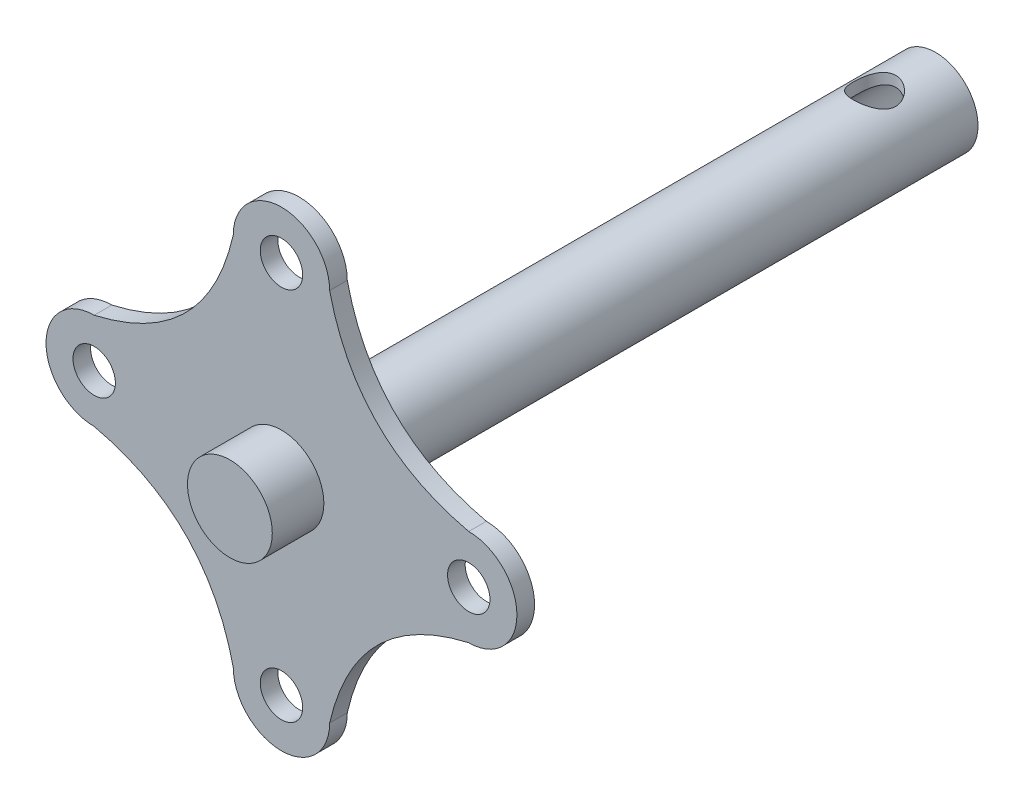
ISO-10303-21;
HEADER;
FILE_DESCRIPTION(('STEP AP214'),'2;1');
FILE_NAME('part.step','',(''),(''),'','','');
FILE_SCHEMA(('AUTOMOTIVE_DESIGN { 1 0 10303 214 1 1 1 1 }'));
ENDSEC;
DATA;
#1=APPLICATION_CONTEXT('core data for automotive mechanical design processes');
#2=APPLICATION_PROTOCOL_DEFINITION('international standard','automotive_design',2000,#1);
#3=PRODUCT_CONTEXT('',#1,'mechanical');
#4=PRODUCT('Part','Part','',(#3));
#5=PRODUCT_RELATED_PRODUCT_CATEGORY('part','',(#4));
#6=PRODUCT_DEFINITION_FORMATION('','',#4);
#7=PRODUCT_DEFINITION_CONTEXT('part definition',#1,'design');
#8=PRODUCT_DEFINITION('design','',#6,#7);
#9=PRODUCT_DEFINITION_SHAPE('','',#8);
#10=(LENGTH_UNIT() NAMED_UNIT(*) SI_UNIT(.MILLI.,.METRE.));
#11=(NAMED_UNIT(*) PLANE_ANGLE_UNIT() SI_UNIT($,.RADIAN.));
#12=(NAMED_UNIT(*) SI_UNIT($,.STERADIAN.) SOLID_ANGLE_UNIT());
#13=UNCERTAINTY_MEASURE_WITH_UNIT(LENGTH_MEASURE(1.E-05),#10,'distance_accuracy_value','');
#14=(GEOMETRIC_REPRESENTATION_CONTEXT(3) GLOBAL_UNCERTAINTY_ASSIGNED_CONTEXT((#13)) GLOBAL_UNIT_ASSIGNED_CONTEXT((#10,
#11,#12)) REPRESENTATION_CONTEXT('',''));
#15=CARTESIAN_POINT('',(0.,0.,0.));
#16=DIRECTION('',(0.,0.,1.));
#17=DIRECTION('',(1.,0.,0.));
#18=AXIS2_PLACEMENT_3D('',#15,#16,#17);
#19=CARTESIAN_POINT('',(-17.9605122421383,17.9605122421383,0.));
#20=DIRECTION('',(0.,0.,1.));
#21=DIRECTION('',(1.,0.,0.));
#22=AXIS2_PLACEMENT_3D('',#19,#20,#21);
#23=PLANE('',#22);
#24=CARTESIAN_POINT('',(-35.052,3.67150211667388E-13,0.));
#25=DIRECTION('',(0.,0.,1.));
#26=DIRECTION('',(1.,0.,0.));
#27=AXIS2_PLACEMENT_3D('',#24,#25,#26);
#28=CIRCLE('',#27,3.96875);
#29=CARTESIAN_POINT('',(-31.08325,3.67150211667388E-13,0.));
#30=VERTEX_POINT('',#29);
#31=EDGE_CURVE('E259',#30,#30,#28,.T.);
#32=ORIENTED_EDGE('',*,*,#31,.T.);
#33=EDGE_LOOP('',(#32));
#34=FACE_BOUND('',#33,.T.);
#35=CARTESIAN_POINT('',(35.052,-1.22383403889129E-13,0.));
#36=DIRECTION('',(0.,0.,1.));
#37=DIRECTION('',(1.,0.,0.));
#38=AXIS2_PLACEMENT_3D('',#35,#36,#37);
#39=CIRCLE('',#38,3.96875);
#40=CARTESIAN_POINT('',(39.02075,-1.22383403889129E-13,0.));
#41=VERTEX_POINT('',#40);
#42=EDGE_CURVE('E270',#41,#41,#39,.T.);
#43=ORIENTED_EDGE('',*,*,#42,.T.);
#44=EDGE_LOOP('',(#43));
#45=FACE_BOUND('',#44,.T.);
#46=CARTESIAN_POINT('',(-9.01700000000001,35.052,0.));
#47=CARTESIAN_POINT('',(-13.8865244842766,13.8865244842766,0.));
#48=CARTESIAN_POINT('',(-35.052,9.017,0.));
#49=B_SPLINE_CURVE_WITH_KNOTS('',2,(#46,#47,#48),.UNSPECIFIED.,.F.,.F.,(3,3),(0.,1.),.UNSPECIFIED.);
#50=CARTESIAN_POINT('',(-9.01700000000001,35.052,0.));
#51=VERTEX_POINT('',#50);
#52=CARTESIAN_POINT('',(-35.052,9.01700000000038,0.));
#53=VERTEX_POINT('',#52);
#54=EDGE_CURVE('E282',#51,#53,#49,.T.);
#55=ORIENTED_EDGE('',*,*,#54,.F.);
#56=CARTESIAN_POINT('',(0.,35.052,0.));
#57=DIRECTION('',(0.,0.,1.));
#58=DIRECTION('',(1.,0.,0.));
#59=AXIS2_PLACEMENT_3D('',#56,#57,#58);
#60=CIRCLE('',#59,9.01700000000001);
#61=CARTESIAN_POINT('',(9.01700000000001,35.052,0.));
#62=VERTEX_POINT('',#61);
#63=EDGE_CURVE('E86',#62,#51,#60,.T.);
#64=ORIENTED_EDGE('',*,*,#63,.F.);
#65=CARTESIAN_POINT('',(35.052,9.01700000000001,0.));
#66=CARTESIAN_POINT('',(13.8865244842766,13.8865244842766,0.));
#67=CARTESIAN_POINT('',(9.01700000000001,35.052,0.));
#68=B_SPLINE_CURVE_WITH_KNOTS('',2,(#65,#66,#67),.UNSPECIFIED.,.F.,.F.,(3,3),(0.,1.),.UNSPECIFIED.);
#69=CARTESIAN_POINT('',(35.052,9.01700000000001,0.));
#70=VERTEX_POINT('',#69);
#71=EDGE_CURVE('E80',#70,#62,#68,.T.);
#72=ORIENTED_EDGE('',*,*,#71,.F.);
#73=CARTESIAN_POINT('',(35.052,-1.22383403889129E-13,0.));
#74=DIRECTION('',(0.,0.,1.));
#75=DIRECTION('',(1.,0.,0.));
#76=AXIS2_PLACEMENT_3D('',#73,#74,#75);
#77=CIRCLE('',#76,9.01700000000001);
#78=CARTESIAN_POINT('',(35.052,-9.01700000000013,0.));
#79=VERTEX_POINT('',#78);
#80=EDGE_CURVE('E123',#79,#70,#77,.T.);
#81=ORIENTED_EDGE('',*,*,#80,.F.);
#82=CARTESIAN_POINT('',(9.01700000000001,-35.052,0.));
#83=CARTESIAN_POINT('',(13.8865244842766,-13.8865244842766,0.));
#84=CARTESIAN_POINT('',(35.052,-9.01700000000001,0.));
#85=B_SPLINE_CURVE_WITH_KNOTS('',2,(#82,#83,#84),.UNSPECIFIED.,.F.,.F.,(3,3),(0.,1.),.UNSPECIFIED.);
#86=CARTESIAN_POINT('',(9.01700000000001,-35.052,0.));
#87=VERTEX_POINT('',#86);
#88=EDGE_CURVE('E330',#87,#79,#85,.T.);
#89=ORIENTED_EDGE('',*,*,#88,.F.);
#90=CARTESIAN_POINT('',(-2.44766807778259E-13,-35.052,0.));
#91=DIRECTION('',(0.,0.,1.));
#92=DIRECTION('',(1.,0.,0.));
#93=AXIS2_PLACEMENT_3D('',#90,#91,#92);
#94=CIRCLE('',#93,9.01700000000001);
#95=CARTESIAN_POINT('',(-9.01700000000026,-35.052,0.));
#96=VERTEX_POINT('',#95);
#97=EDGE_CURVE('E325',#96,#87,#94,.T.);
#98=ORIENTED_EDGE('',*,*,#97,.F.);
#99=CARTESIAN_POINT('',(-35.052,-9.01700000000002,0.));
#100=CARTESIAN_POINT('',(-13.8865244842766,-13.8865244842766,0.));
#101=CARTESIAN_POINT('',(-9.01700000000001,-35.052,0.));
#102=B_SPLINE_CURVE_WITH_KNOTS('',2,(#99,#100,#101),.UNSPECIFIED.,.F.,.F.,(3,3),(0.,1.),.UNSPECIFIED.);
#103=CARTESIAN_POINT('',(-35.052,-9.01700000000002,0.));
#104=VERTEX_POINT('',#103);
#105=EDGE_CURVE('E314',#104,#96,#102,.T.);
#106=ORIENTED_EDGE('',*,*,#105,.F.);
#107=CARTESIAN_POINT('',(-35.052,3.67150211667388E-13,0.));
#108=DIRECTION('',(0.,0.,1.));
#109=DIRECTION('',(1.,0.,0.));
#110=AXIS2_PLACEMENT_3D('',#107,#108,#109);
#111=CIRCLE('',#110,9.01700000000001);
#112=EDGE_CURVE('E311',#53,#104,#111,.T.);
#113=ORIENTED_EDGE('',*,*,#112,.F.);
#114=EDGE_LOOP('',(#55,#64,#72,#81,#89,#98,#106,#113));
#115=FACE_BOUND('',#114,.T.);
#116=CARTESIAN_POINT('',(0.,35.052,0.));
#117=DIRECTION('',(0.,0.,1.));
#118=DIRECTION('',(1.,0.,0.));
#119=AXIS2_PLACEMENT_3D('',#116,#117,#118);
#120=CIRCLE('',#119,3.96875);
#121=CARTESIAN_POINT('',(3.96875,35.052,0.));
#122=VERTEX_POINT('',#121);
#123=EDGE_CURVE('E276',#122,#122,#120,.T.);
#124=ORIENTED_EDGE('',*,*,#123,.T.);
#125=EDGE_LOOP('',(#124));
#126=FACE_BOUND('',#125,.T.);
#127=CARTESIAN_POINT('',(-2.44766807778259E-13,-35.052,0.));
#128=DIRECTION('',(0.,0.,1.));
#129=DIRECTION('',(1.,0.,0.));
#130=AXIS2_PLACEMENT_3D('',#127,#128,#129);
#131=CIRCLE('',#130,3.96875);
#132=CARTESIAN_POINT('',(3.96874999999976,-35.052,0.));
#133=VERTEX_POINT('',#132);
#134=EDGE_CURVE('E265',#133,#133,#131,.T.);
#135=ORIENTED_EDGE('',*,*,#134,.T.);
#136=EDGE_LOOP('',(#135));
#137=FACE_BOUND('',#136,.T.);
#138=CARTESIAN_POINT('',(0.,0.,0.));
#139=DIRECTION('',(0.,0.,1.));
#140=DIRECTION('',(1.,0.,0.));
#141=AXIS2_PLACEMENT_3D('',#138,#139,#140);
#142=CIRCLE('',#141,7.9375);
#143=CARTESIAN_POINT('',(7.9375,0.,0.));
#144=VERTEX_POINT('',#143);
#145=EDGE_CURVE('E11',#144,#144,#142,.F.);
#146=ORIENTED_EDGE('',*,*,#145,.F.);
#147=EDGE_LOOP('',(#146));
#148=FACE_BOUND('',#147,.T.);
#149=ADVANCED_FACE('F33',(#34,#45,#115,#126,#137,#148),#23,.F.);
#150=CARTESIAN_POINT('',(-17.9605122421383,17.9605122421383,3.302));
#151=DIRECTION('',(0.,0.,1.));
#152=DIRECTION('',(1.,0.,0.));
#153=AXIS2_PLACEMENT_3D('',#150,#151,#152);
#154=PLANE('',#153);
#155=CARTESIAN_POINT('',(-35.052,3.67150211667388E-13,3.302));
#156=DIRECTION('',(0.,0.,1.));
#157=DIRECTION('',(1.,0.,0.));
#158=AXIS2_PLACEMENT_3D('',#155,#156,#157);
#159=CIRCLE('',#158,3.96875);
#160=CARTESIAN_POINT('',(-31.08325,3.67150211667388E-13,3.302));
#161=VERTEX_POINT('',#160);
#162=EDGE_CURVE('E262',#161,#161,#159,.T.);
#163=ORIENTED_EDGE('',*,*,#162,.F.);
#164=EDGE_LOOP('',(#163));
#165=FACE_BOUND('',#164,.T.);
#166=CARTESIAN_POINT('',(35.052,-1.22383403889129E-13,3.302));
#167=DIRECTION('',(0.,0.,1.));
#168=DIRECTION('',(1.,0.,0.));
#169=AXIS2_PLACEMENT_3D('',#166,#167,#168);
#170=CIRCLE('',#169,3.96875);
#171=CARTESIAN_POINT('',(39.02075,-1.22383403889129E-13,3.302));
#172=VERTEX_POINT('',#171);
#173=EDGE_CURVE('E273',#172,#172,#170,.T.);
#174=ORIENTED_EDGE('',*,*,#173,.F.);
#175=EDGE_LOOP('',(#174));
#176=FACE_BOUND('',#175,.T.);
#177=CARTESIAN_POINT('',(-9.01700000000001,35.052,3.302));
#178=CARTESIAN_POINT('',(-13.8865244842766,13.8865244842766,3.302));
#179=CARTESIAN_POINT('',(-35.052,9.017,3.302));
#180=B_SPLINE_CURVE_WITH_KNOTS('',2,(#177,#178,#179),.UNSPECIFIED.,.F.,.F.,(3,3),(0.,1.),.UNSPECIFIED.);
#181=CARTESIAN_POINT('',(-9.01700000000001,35.052,3.302));
#182=VERTEX_POINT('',#181);
#183=CARTESIAN_POINT('',(-35.052,9.01700000000038,3.302));
#184=VERTEX_POINT('',#183);
#185=EDGE_CURVE('E284',#182,#184,#180,.T.);
#186=ORIENTED_EDGE('',*,*,#185,.T.);
#187=CARTESIAN_POINT('',(-35.052,3.67150211667388E-13,3.302));
#188=DIRECTION('',(0.,0.,1.));
#189=DIRECTION('',(1.,0.,0.));
#190=AXIS2_PLACEMENT_3D('',#187,#188,#189);
#191=CIRCLE('',#190,9.01700000000001);
#192=CARTESIAN_POINT('',(-35.052,-9.01700000000002,3.302));
#193=VERTEX_POINT('',#192);
#194=EDGE_CURVE('E95',#184,#193,#191,.T.);
#195=ORIENTED_EDGE('',*,*,#194,.T.);
#196=CARTESIAN_POINT('',(-35.052,-9.01700000000002,3.302));
#197=CARTESIAN_POINT('',(-13.8865244842766,-13.8865244842766,3.302));
#198=CARTESIAN_POINT('',(-9.01700000000001,-35.052,3.302));
#199=B_SPLINE_CURVE_WITH_KNOTS('',2,(#196,#197,#198),.UNSPECIFIED.,.F.,.F.,(3,3),(0.,1.),.UNSPECIFIED.);
#200=CARTESIAN_POINT('',(-9.01700000000026,-35.052,3.302));
#201=VERTEX_POINT('',#200);
#202=EDGE_CURVE('E162',#193,#201,#199,.T.);
#203=ORIENTED_EDGE('',*,*,#202,.T.);
#204=CARTESIAN_POINT('',(-2.44766807778259E-13,-35.052,3.302));
#205=DIRECTION('',(0.,0.,1.));
#206=DIRECTION('',(1.,0.,0.));
#207=AXIS2_PLACEMENT_3D('',#204,#205,#206);
#208=CIRCLE('',#207,9.01700000000001);
#209=CARTESIAN_POINT('',(9.01700000000001,-35.052,3.302));
#210=VERTEX_POINT('',#209);
#211=EDGE_CURVE('E157',#201,#210,#208,.T.);
#212=ORIENTED_EDGE('',*,*,#211,.T.);
#213=CARTESIAN_POINT('',(9.01700000000001,-35.052,3.302));
#214=CARTESIAN_POINT('',(13.8865244842766,-13.8865244842766,3.302));
#215=CARTESIAN_POINT('',(35.052,-9.01700000000001,3.302));
#216=B_SPLINE_CURVE_WITH_KNOTS('',2,(#213,#214,#215),.UNSPECIFIED.,.F.,.F.,(3,3),(0.,1.),.UNSPECIFIED.);
#217=CARTESIAN_POINT('',(35.052,-9.01700000000013,3.302));
#218=VERTEX_POINT('',#217);
#219=EDGE_CURVE('E115',#210,#218,#216,.T.);
#220=ORIENTED_EDGE('',*,*,#219,.T.);
#221=CARTESIAN_POINT('',(35.052,-1.22383403889129E-13,3.302));
#222=DIRECTION('',(0.,0.,1.));
#223=DIRECTION('',(1.,0.,0.));
#224=AXIS2_PLACEMENT_3D('',#221,#222,#223);
#225=CIRCLE('',#224,9.01700000000001);
#226=CARTESIAN_POINT('',(35.052,9.01700000000001,3.302));
#227=VERTEX_POINT('',#226);
#228=EDGE_CURVE('E108',#218,#227,#225,.T.);
#229=ORIENTED_EDGE('',*,*,#228,.T.);
#230=CARTESIAN_POINT('',(35.052,9.01700000000001,3.302));
#231=CARTESIAN_POINT('',(13.8865244842766,13.8865244842766,3.302));
#232=CARTESIAN_POINT('',(9.01700000000001,35.052,3.302));
#233=B_SPLINE_CURVE_WITH_KNOTS('',2,(#230,#231,#232),.UNSPECIFIED.,.F.,.F.,(3,3),(0.,1.),.UNSPECIFIED.);
#234=CARTESIAN_POINT('',(9.01700000000001,35.052,3.302));
#235=VERTEX_POINT('',#234);
#236=EDGE_CURVE('E113',#227,#235,#233,.T.);
#237=ORIENTED_EDGE('',*,*,#236,.T.);
#238=CARTESIAN_POINT('',(0.,35.052,3.302));
#239=DIRECTION('',(0.,0.,1.));
#240=DIRECTION('',(1.,0.,0.));
#241=AXIS2_PLACEMENT_3D('',#238,#239,#240);
#242=CIRCLE('',#241,9.01700000000001);
#243=EDGE_CURVE('E51',#235,#182,#242,.T.);
#244=ORIENTED_EDGE('',*,*,#243,.T.);
#245=EDGE_LOOP('',(#186,#195,#203,#212,#220,#229,#237,#244));
#246=FACE_BOUND('',#245,.T.);
#247=CARTESIAN_POINT('',(0.,35.052,3.302));
#248=DIRECTION('',(0.,0.,1.));
#249=DIRECTION('',(1.,0.,0.));
#250=AXIS2_PLACEMENT_3D('',#247,#248,#249);
#251=CIRCLE('',#250,3.96875);
#252=CARTESIAN_POINT('',(3.96875,35.052,3.302));
#253=VERTEX_POINT('',#252);
#254=EDGE_CURVE('E279',#253,#253,#251,.T.);
#255=ORIENTED_EDGE('',*,*,#254,.F.);
#256=EDGE_LOOP('',(#255));
#257=FACE_BOUND('',#256,.T.);
#258=CARTESIAN_POINT('',(-2.44766807778259E-13,-35.052,3.302));
#259=DIRECTION('',(0.,0.,1.));
#260=DIRECTION('',(1.,0.,0.));
#261=AXIS2_PLACEMENT_3D('',#258,#259,#260);
#262=CIRCLE('',#261,3.96875);
#263=CARTESIAN_POINT('',(3.96874999999976,-35.052,3.302));
#264=VERTEX_POINT('',#263);
#265=EDGE_CURVE('E267',#264,#264,#262,.T.);
#266=ORIENTED_EDGE('',*,*,#265,.F.);
#267=EDGE_LOOP('',(#266));
#268=FACE_BOUND('',#267,.T.);
#269=CARTESIAN_POINT('',(0.,0.,3.302));
#270=DIRECTION('',(0.,0.,1.));
#271=DIRECTION('',(1.,0.,0.));
#272=AXIS2_PLACEMENT_3D('',#269,#270,#271);
#273=CIRCLE('',#272,7.9375);
#274=CARTESIAN_POINT('',(7.9375,0.,3.302));
#275=VERTEX_POINT('',#274);
#276=EDGE_CURVE('E255',#275,#275,#273,.T.);
#277=ORIENTED_EDGE('',*,*,#276,.F.);
#278=EDGE_LOOP('',(#277));
#279=FACE_BOUND('',#278,.T.);
#280=ADVANCED_FACE('F110',(#165,#176,#246,#257,#268,#279),#154,.T.);
#281=DIRECTION('',(0.,0.,-1.));
#282=VECTOR('',#281,1.);
#283=SURFACE_OF_LINEAR_EXTRUSION('',#180,#282);
#284=ORIENTED_EDGE('',*,*,#54,.T.);
#285=DIRECTION('',(0.,0.,-1.));
#286=VECTOR('',#285,1.);
#287=CARTESIAN_POINT('',(-35.052,9.01700000000038,3.302));
#288=LINE('',#287,#286);
#289=EDGE_CURVE('E43',#184,#53,#288,.T.);
#290=ORIENTED_EDGE('',*,*,#289,.F.);
#291=ORIENTED_EDGE('',*,*,#185,.F.);
#292=DIRECTION('',(0.,0.,-1.));
#293=VECTOR('',#292,1.);
#294=CARTESIAN_POINT('',(-9.01700000000001,35.052,3.302));
#295=LINE('',#294,#293);
#296=EDGE_CURVE('E129',#182,#51,#295,.T.);
#297=ORIENTED_EDGE('',*,*,#296,.T.);
#298=EDGE_LOOP('',(#284,#290,#291,#297));
#299=FACE_BOUND('',#298,.T.);
#300=ADVANCED_FACE('F35',(#299),#283,.F.);
#301=CARTESIAN_POINT('',(-35.052,3.67150211667388E-13,3.302));
#302=DIRECTION('',(0.,0.,-1.));
#303=DIRECTION('',(-1.,0.,0.));
#304=AXIS2_PLACEMENT_3D('',#301,#302,#303);
#305=CYLINDRICAL_SURFACE('',#304,9.01700000000001);
#306=ORIENTED_EDGE('',*,*,#112,.T.);
#307=DIRECTION('',(0.,0.,-1.));
#308=VECTOR('',#307,1.);
#309=CARTESIAN_POINT('',(-35.052,-9.01700000000002,3.302));
#310=LINE('',#309,#308);
#311=EDGE_CURVE('E308',#193,#104,#310,.T.);
#312=ORIENTED_EDGE('',*,*,#311,.F.);
#313=ORIENTED_EDGE('',*,*,#194,.F.);
#314=ORIENTED_EDGE('',*,*,#289,.T.);
#315=EDGE_LOOP('',(#306,#312,#313,#314));
#316=FACE_BOUND('',#315,.T.);
#317=ADVANCED_FACE('F172',(#316),#305,.T.);
#318=DIRECTION('',(0.,0.,-1.));
#319=VECTOR('',#318,1.);
#320=SURFACE_OF_LINEAR_EXTRUSION('',#199,#319);
#321=ORIENTED_EDGE('',*,*,#105,.T.);
#322=DIRECTION('',(0.,0.,-1.));
#323=VECTOR('',#322,1.);
#324=CARTESIAN_POINT('',(-9.01700000000026,-35.052,3.302));
#325=LINE('',#324,#323);
#326=EDGE_CURVE('E305',#201,#96,#325,.T.);
#327=ORIENTED_EDGE('',*,*,#326,.F.);
#328=ORIENTED_EDGE('',*,*,#202,.F.);
#329=ORIENTED_EDGE('',*,*,#311,.T.);
#330=EDGE_LOOP('',(#321,#327,#328,#329));
#331=FACE_BOUND('',#330,.T.);
#332=ADVANCED_FACE('F170',(#331),#320,.F.);
#333=CARTESIAN_POINT('',(-2.44766807778259E-13,-35.052,3.302));
#334=DIRECTION('',(0.,0.,-1.));
#335=DIRECTION('',(-1.,0.,0.));
#336=AXIS2_PLACEMENT_3D('',#333,#334,#335);
#337=CYLINDRICAL_SURFACE('',#336,9.01700000000001);
#338=ORIENTED_EDGE('',*,*,#97,.T.);
#339=DIRECTION('',(0.,0.,-1.));
#340=VECTOR('',#339,1.);
#341=CARTESIAN_POINT('',(9.01700000000001,-35.052,3.302));
#342=LINE('',#341,#340);
#343=EDGE_CURVE('E302',#210,#87,#342,.T.);
#344=ORIENTED_EDGE('',*,*,#343,.F.);
#345=ORIENTED_EDGE('',*,*,#211,.F.);
#346=ORIENTED_EDGE('',*,*,#326,.T.);
#347=EDGE_LOOP('',(#338,#344,#345,#346));
#348=FACE_BOUND('',#347,.T.);
#349=ADVANCED_FACE('F150',(#348),#337,.T.);
#350=DIRECTION('',(0.,0.,-1.));
#351=VECTOR('',#350,1.);
#352=SURFACE_OF_LINEAR_EXTRUSION('',#216,#351);
#353=ORIENTED_EDGE('',*,*,#88,.T.);
#354=DIRECTION('',(0.,0.,-1.));
#355=VECTOR('',#354,1.);
#356=CARTESIAN_POINT('',(35.052,-9.01700000000013,3.302));
#357=LINE('',#356,#355);
#358=EDGE_CURVE('E124',#218,#79,#357,.T.);
#359=ORIENTED_EDGE('',*,*,#358,.F.);
#360=ORIENTED_EDGE('',*,*,#219,.F.);
#361=ORIENTED_EDGE('',*,*,#343,.T.);
#362=EDGE_LOOP('',(#353,#359,#360,#361));
#363=FACE_BOUND('',#362,.T.);
#364=ADVANCED_FACE('F147',(#363),#352,.F.);
#365=CARTESIAN_POINT('',(35.052,-1.22383403889129E-13,3.302));
#366=DIRECTION('',(0.,0.,-1.));
#367=DIRECTION('',(-1.,0.,0.));
#368=AXIS2_PLACEMENT_3D('',#365,#366,#367);
#369=CYLINDRICAL_SURFACE('',#368,9.01700000000001);
#370=ORIENTED_EDGE('',*,*,#80,.T.);
#371=DIRECTION('',(0.,0.,-1.));
#372=VECTOR('',#371,1.);
#373=CARTESIAN_POINT('',(35.052,9.01700000000001,3.302));
#374=LINE('',#373,#372);
#375=EDGE_CURVE('E120',#227,#70,#374,.T.);
#376=ORIENTED_EDGE('',*,*,#375,.F.);
#377=ORIENTED_EDGE('',*,*,#228,.F.);
#378=ORIENTED_EDGE('',*,*,#358,.T.);
#379=EDGE_LOOP('',(#370,#376,#377,#378));
#380=FACE_BOUND('',#379,.T.);
#381=ADVANCED_FACE('F121',(#380),#369,.T.);
#382=DIRECTION('',(0.,0.,-1.));
#383=VECTOR('',#382,1.);
#384=SURFACE_OF_LINEAR_EXTRUSION('',#233,#383);
#385=ORIENTED_EDGE('',*,*,#71,.T.);
#386=DIRECTION('',(0.,0.,-1.));
#387=VECTOR('',#386,1.);
#388=CARTESIAN_POINT('',(9.01700000000001,35.052,3.302));
#389=LINE('',#388,#387);
#390=EDGE_CURVE('E125',#235,#62,#389,.T.);
#391=ORIENTED_EDGE('',*,*,#390,.F.);
#392=ORIENTED_EDGE('',*,*,#236,.F.);
#393=ORIENTED_EDGE('',*,*,#375,.T.);
#394=EDGE_LOOP('',(#385,#391,#392,#393));
#395=FACE_BOUND('',#394,.T.);
#396=ADVANCED_FACE('F127',(#395),#384,.F.);
#397=CARTESIAN_POINT('',(0.,35.052,3.302));
#398=DIRECTION('',(0.,0.,-1.));
#399=DIRECTION('',(-1.,0.,0.));
#400=AXIS2_PLACEMENT_3D('',#397,#398,#399);
#401=CYLINDRICAL_SURFACE('',#400,9.01700000000001);
#402=ORIENTED_EDGE('',*,*,#63,.T.);
#403=ORIENTED_EDGE('',*,*,#296,.F.);
#404=ORIENTED_EDGE('',*,*,#243,.F.);
#405=ORIENTED_EDGE('',*,*,#390,.T.);
#406=EDGE_LOOP('',(#402,#403,#404,#405));
#407=FACE_BOUND('',#406,.T.);
#408=ADVANCED_FACE('F143',(#407),#401,.T.);
#409=CARTESIAN_POINT('',(0.,35.052,3.302));
#410=DIRECTION('',(0.,0.,-1.));
#411=DIRECTION('',(-1.,0.,0.));
#412=AXIS2_PLACEMENT_3D('',#409,#410,#411);
#413=CYLINDRICAL_SURFACE('',#412,3.96875);
#414=ORIENTED_EDGE('',*,*,#254,.T.);
#415=EDGE_LOOP('',(#414));
#416=FACE_BOUND('',#415,.T.);
#417=ORIENTED_EDGE('',*,*,#123,.F.);
#418=EDGE_LOOP('',(#417));
#419=FACE_BOUND('',#418,.T.);
#420=ADVANCED_FACE('F189',(#416,#419),#413,.F.);
#421=CARTESIAN_POINT('',(35.052,-1.22383403889129E-13,3.302));
#422=DIRECTION('',(0.,0.,-1.));
#423=DIRECTION('',(-1.,0.,0.));
#424=AXIS2_PLACEMENT_3D('',#421,#422,#423);
#425=CYLINDRICAL_SURFACE('',#424,3.96875);
#426=ORIENTED_EDGE('',*,*,#173,.T.);
#427=EDGE_LOOP('',(#426));
#428=FACE_BOUND('',#427,.T.);
#429=ORIENTED_EDGE('',*,*,#42,.F.);
#430=EDGE_LOOP('',(#429));
#431=FACE_BOUND('',#430,.T.);
#432=ADVANCED_FACE('F192',(#428,#431),#425,.F.);
#433=CARTESIAN_POINT('',(-2.44766807778259E-13,-35.052,3.302));
#434=DIRECTION('',(0.,0.,-1.));
#435=DIRECTION('',(-1.,0.,0.));
#436=AXIS2_PLACEMENT_3D('',#433,#434,#435);
#437=CYLINDRICAL_SURFACE('',#436,3.96875);
#438=ORIENTED_EDGE('',*,*,#265,.T.);
#439=EDGE_LOOP('',(#438));
#440=FACE_BOUND('',#439,.T.);
#441=ORIENTED_EDGE('',*,*,#134,.F.);
#442=EDGE_LOOP('',(#441));
#443=FACE_BOUND('',#442,.T.);
#444=ADVANCED_FACE('F196',(#440,#443),#437,.F.);
#445=CARTESIAN_POINT('',(-35.052,3.67150211667388E-13,3.302));
#446=DIRECTION('',(0.,0.,-1.));
#447=DIRECTION('',(-1.,0.,0.));
#448=AXIS2_PLACEMENT_3D('',#445,#446,#447);
#449=CYLINDRICAL_SURFACE('',#448,3.96875);
#450=ORIENTED_EDGE('',*,*,#162,.T.);
#451=EDGE_LOOP('',(#450));
#452=FACE_BOUND('',#451,.T.);
#453=ORIENTED_EDGE('',*,*,#31,.F.);
#454=EDGE_LOOP('',(#453));
#455=FACE_BOUND('',#454,.T.);
#456=ADVANCED_FACE('F200',(#452,#455),#449,.F.);
#457=CARTESIAN_POINT('',(0.,0.,12.954));
#458=DIRECTION('',(0.,0.,-1.));
#459=DIRECTION('',(-1.,0.,0.));
#460=AXIS2_PLACEMENT_3D('',#457,#458,#459);
#461=CYLINDRICAL_SURFACE('',#460,7.9375);
#462=CARTESIAN_POINT('',(0.,0.,12.954));
#463=DIRECTION('',(0.,0.,1.));
#464=DIRECTION('',(1.,0.,0.));
#465=AXIS2_PLACEMENT_3D('',#462,#463,#464);
#466=CIRCLE('',#465,7.9375);
#467=CARTESIAN_POINT('',(7.9375,0.,12.954));
#468=VERTEX_POINT('',#467);
#469=EDGE_CURVE('E256',#468,#468,#466,.T.);
#470=ORIENTED_EDGE('',*,*,#469,.F.);
#471=EDGE_LOOP('',(#470));
#472=FACE_BOUND('',#471,.T.);
#473=ORIENTED_EDGE('',*,*,#276,.T.);
#474=EDGE_LOOP('',(#473));
#475=FACE_BOUND('',#474,.T.);
#476=ADVANCED_FACE('F204',(#472,#475),#461,.T.);
#477=CARTESIAN_POINT('',(0.,0.,12.954));
#478=DIRECTION('',(0.,0.,1.));
#479=DIRECTION('',(1.,0.,0.));
#480=AXIS2_PLACEMENT_3D('',#477,#478,#479);
#481=PLANE('',#480);
#482=ORIENTED_EDGE('',*,*,#469,.T.);
#483=EDGE_LOOP('',(#482));
#484=FACE_BOUND('',#483,.T.);
#485=ADVANCED_FACE('F208',(#484),#481,.T.);
#486=CARTESIAN_POINT('',(0.,0.,-119.126));
#487=DIRECTION('',(0.,0.,1.));
#488=DIRECTION('',(1.,0.,0.));
#489=AXIS2_PLACEMENT_3D('',#486,#487,#488);
#490=CYLINDRICAL_SURFACE('',#489,7.9375);
#491=CARTESIAN_POINT('',(0.,7.93749999999999,-103.72725));
#492=CARTESIAN_POINT('',(0.104369410089829,7.93749964710061,-103.727250401685));
#493=CARTESIAN_POINT('',(0.208746323529613,7.93543652404865,-103.731372000618));
#494=CARTESIAN_POINT('',(0.416729911813045,7.9272367842324,-103.747810186864));
#495=CARTESIAN_POINT('',(0.520336231742607,7.92109839537058,-103.76013033926));
#496=CARTESIAN_POINT('',(0.726110731039585,7.90489272677887,-103.792847002862));
#497=CARTESIAN_POINT('',(0.82827664337823,7.89481984439238,-103.813255031683));
#498=CARTESIAN_POINT('',(1.03030258640491,7.87100738632354,-103.861906916872));
#499=CARTESIAN_POINT('',(1.13016165631416,7.8572663117564,-103.890153976587));
#500=CARTESIAN_POINT('',(1.42440199017918,7.81115458867984,-103.985961135562));
#501=CARTESIAN_POINT('',(1.61448373622076,7.77380867280489,-104.064755457559));
#502=CARTESIAN_POINT('',(1.97834395847019,7.68928332519479,-104.249427407954));
#503=CARTESIAN_POINT('',(2.15212371864541,7.64210466884467,-104.355302900948));
#504=CARTESIAN_POINT('',(2.49041365625516,7.53888923529746,-104.59845990211));
#505=CARTESIAN_POINT('',(2.65372701475934,7.48248923455529,-104.737253901568));
#506=CARTESIAN_POINT('',(2.95584177494967,7.3683815511092,-105.038996425573));
#507=CARTESIAN_POINT('',(3.09462449787672,7.31067290934778,-105.201963184207));
#508=CARTESIAN_POINT('',(3.3546096064078,7.19529548141556,-105.562776026293));
#509=CARTESIAN_POINT('',(3.47361399641898,7.13797684614345,-105.762346919085));
#510=CARTESIAN_POINT('',(3.62524200471708,7.06149696460578,-106.076685051361));
#511=CARTESIAN_POINT('',(3.67131592751051,7.03758021096291,-106.184000173253));
#512=CARTESIAN_POINT('',(3.7540313686651,6.99380755132025,-106.402982213492));
#513=CARTESIAN_POINT('',(3.7906784717335,6.973949242426,-106.514646509907));
#514=CARTESIAN_POINT('',(3.85217834905982,6.94015758970911,-106.734763014468));
#515=CARTESIAN_POINT('',(3.8776017912118,6.92594266308114,-106.84301285339));
#516=CARTESIAN_POINT('',(3.91931981478621,6.9024208871212,-107.061734737486));
#517=CARTESIAN_POINT('',(3.93561923963159,6.89311143390609,-107.172205571333));
#518=CARTESIAN_POINT('',(3.95884711357792,6.87979769947166,-107.394381045861));
#519=CARTESIAN_POINT('',(3.96578120630086,6.87579022326954,-107.506084902556));
#520=CARTESIAN_POINT('',(3.97018212403133,6.87325014427843,-107.729734849304));
#521=CARTESIAN_POINT('',(3.9676498522986,6.87471701913886,-107.841680915226));
#522=CARTESIAN_POINT('',(3.9540316440864,6.882557023164,-108.05136621924));
#523=CARTESIAN_POINT('',(3.94400811209084,6.88832056579457,-108.149198943951));
#524=CARTESIAN_POINT('',(3.91679667622581,6.90382839940708,-108.343552771446));
#525=CARTESIAN_POINT('',(3.89960652217992,6.913573940638,-108.440073452438));
#526=CARTESIAN_POINT('',(3.83755551593145,6.94833703678735,-108.726663670924));
#527=CARTESIAN_POINT('',(3.78220441315265,6.97888716992628,-108.913905648823));
#528=CARTESIAN_POINT('',(3.64414196450859,7.05197183776459,-109.280470189546));
#529=CARTESIAN_POINT('',(3.56082334971471,7.09476894900454,-109.459506695853));
#530=CARTESIAN_POINT('',(3.36963314536097,7.18754170992462,-109.801947919929));
#531=CARTESIAN_POINT('',(3.26175052720868,7.23752058029641,-109.965345569314));
#532=CARTESIAN_POINT('',(3.00858289843047,7.34667673244783,-110.293629109191));
#533=CARTESIAN_POINT('',(2.86028985758813,7.40621681108501,-110.456076683437));
#534=CARTESIAN_POINT('',(2.53820246112426,7.52267817944741,-110.754873984575));
#535=CARTESIAN_POINT('',(2.36439598770339,7.57959820779118,-110.891211238861));
#536=CARTESIAN_POINT('',(2.08304281490361,7.65996142001121,-111.076137772166));
#537=CARTESIAN_POINT('',(1.98335106121145,7.68643989980452,-111.135598308505));
#538=CARTESIAN_POINT('',(1.77856405970502,7.73638797457795,-111.245815178161));
#539=CARTESIAN_POINT('',(1.67347111414213,7.7598588368905,-111.296575180723));
#540=CARTESIAN_POINT('',(1.45861724535511,7.80309870748913,-111.388841629229));
#541=CARTESIAN_POINT('',(1.34885822252743,7.82286920546371,-111.430351800249));
#542=CARTESIAN_POINT('',(1.12546755793707,7.85811727288069,-111.503638532782));
#543=CARTESIAN_POINT('',(1.01183636334388,7.87359533615191,-111.535416214027));
#544=CARTESIAN_POINT('',(0.791208415491776,7.89868242604485,-111.586592263106));
#545=CARTESIAN_POINT('',(0.684441602894769,7.90867135755798,-111.606797912705));
#546=CARTESIAN_POINT('',(0.469303417873443,7.9243478563447,-111.638403897866));
#547=CARTESIAN_POINT('',(0.360932188154226,7.93003580385413,-111.649805011809));
#548=CARTESIAN_POINT('',(0.14351838140585,7.93694735700268,-111.663649139736));
#549=CARTESIAN_POINT('',(0.0344760774196125,7.93817267176881,-111.666095583235));
#550=CARTESIAN_POINT('',(-0.183393594918013,7.93612884272146,-111.662007353531));
#551=CARTESIAN_POINT('',(-0.292220972568113,7.9328598978143,-111.655473077795));
#552=CARTESIAN_POINT('',(-0.500320083529768,7.92234666698602,-111.63436567711));
#553=CARTESIAN_POINT('',(-0.599676397866461,7.91543153005083,-111.620457689248));
#554=CARTESIAN_POINT('',(-0.796761893609953,7.8980306181852,-111.585239665958));
#555=CARTESIAN_POINT('',(-0.894490510702848,7.88754363087236,-111.563927117174));
#556=CARTESIAN_POINT('',(-1.18419302276536,7.85107181593958,-111.489197132444));
#557=CARTESIAN_POINT('',(-1.37287107818242,7.82006600845009,-111.424967907383));
#558=CARTESIAN_POINT('',(-1.74186943050378,7.74637387784252,-111.26787687632));
#559=CARTESIAN_POINT('',(-1.92179650921422,7.70337892840573,-111.174248904181));
#560=CARTESIAN_POINT('',(-2.26401140510817,7.60983879747084,-110.961853583195));
#561=CARTESIAN_POINT('',(-2.42629166335538,7.55929040232657,-110.843075525123));
#562=CARTESIAN_POINT('',(-2.74545105225973,7.4496720486414,-110.570334326544));
#563=CARTESIAN_POINT('',(-2.90023484753893,7.39025272428329,-110.414061404438));
#564=CARTESIAN_POINT('',(-3.18238412157331,7.27321792607378,-110.077512368849));
#565=CARTESIAN_POINT('',(-3.30973063302717,7.21560372346056,-109.897219789113));
#566=CARTESIAN_POINT('',(-3.48032517112611,7.13410756555508,-109.606959063816));
#567=CARTESIAN_POINT('',(-3.53478285096046,7.10720459960475,-109.504277833427));
#568=CARTESIAN_POINT('',(-3.63472626965576,7.05661423482835,-109.293899677459));
#569=CARTESIAN_POINT('',(-3.68021633321872,7.03292528774383,-109.186205200687));
#570=CARTESIAN_POINT('',(-3.76169238454403,6.98968572556066,-108.96657383624));
#571=CARTESIAN_POINT('',(-3.79768600142671,6.97013179105682,-108.854640437156));
#572=CARTESIAN_POINT('',(-3.85972848253965,6.93596861212021,-108.627314029593));
#573=CARTESIAN_POINT('',(-3.88577888656023,6.92135860211885,-108.511921559768));
#574=CARTESIAN_POINT('',(-3.92552100991457,6.89888830107335,-108.289911399127));
#575=CARTESIAN_POINT('',(-3.94015890862892,6.89051477606184,-108.183514470474));
#576=CARTESIAN_POINT('',(-3.96076406455219,6.87869148958232,-107.969617858473));
#577=CARTESIAN_POINT('',(-3.96673223020604,6.87524121223989,-107.862118291853));
#578=CARTESIAN_POINT('',(-3.96990399660637,6.873410736258,-107.646978499338));
#579=CARTESIAN_POINT('',(-3.96711067808675,6.87502875549179,-107.539338336185));
#580=CARTESIAN_POINT('',(-3.95282195577091,6.88325209939153,-107.324861205598));
#581=CARTESIAN_POINT('',(-3.94132690821957,6.88985721988777,-107.218024205465));
#582=CARTESIAN_POINT('',(-3.89701731529281,6.91507935211119,-106.920307676529));
#583=CARTESIAN_POINT('',(-3.85448259337964,6.93908910453775,-106.731230741025));
#584=CARTESIAN_POINT('',(-3.74322760725249,6.99972091146971,-106.363225782623));
#585=CARTESIAN_POINT('',(-3.67449891980817,7.03634702267057,-106.184301045669));
#586=CARTESIAN_POINT('',(-3.50764414414007,7.1210708289439,-105.82821838831));
#587=CARTESIAN_POINT('',(-3.4078532129875,7.16977392107559,-105.651986816236));
#588=CARTESIAN_POINT('',(-3.18353453279148,7.2721522858031,-105.317625380928));
#589=CARTESIAN_POINT('',(-3.05899391421101,7.32583013743155,-105.15950500301));
#590=CARTESIAN_POINT('',(-2.77100358220972,7.4399095177021,-104.845878988688));
#591=CARTESIAN_POINT('',(-2.60466485397247,7.50033552370546,-104.693025538576));
#592=CARTESIAN_POINT('',(-2.24689081707859,7.61515429445718,-104.41675242424));
#593=CARTESIAN_POINT('',(-2.0554420667032,7.66954379879205,-104.293348625268));
#594=CARTESIAN_POINT('',(-1.752233949863,7.74238841685192,-104.133149690033));
#595=CARTESIAN_POINT('',(-1.64802750917782,7.76528966617126,-104.083749277664));
#596=CARTESIAN_POINT('',(-1.43509626570137,7.80744204084633,-103.994000654147));
#597=CARTESIAN_POINT('',(-1.32637371391815,7.82669495867774,-103.953647995917));
#598=CARTESIAN_POINT('',(-1.10545166494248,7.86093871740178,-103.882550814507));
#599=CARTESIAN_POINT('',(-0.993260348832235,7.87593884757798,-103.851785335421));
#600=CARTESIAN_POINT('',(-0.766157034396538,7.90126228219691,-103.800165779984));
#601=CARTESIAN_POINT('',(-0.65124674319286,7.91158844330997,-103.779305649226));
#602=CARTESIAN_POINT('',(-0.446914305999841,7.92540632621577,-103.751479594592));
#603=CARTESIAN_POINT('',(-0.357842962446189,7.92993350293085,-103.742401309177));
#604=CARTESIAN_POINT('',(-0.179182931830079,7.9359805327966,-103.730286256094));
#605=CARTESIAN_POINT('',(-0.0895942305566305,7.93750030294076,-103.72724965518));
#606=CARTESIAN_POINT('',(0.,7.93749999999999,-103.72725));
#607=B_SPLINE_CURVE_WITH_KNOTS('',3,(#491,#492,#493,#494,#495,#496,#497,#498,#499,#500,#501,
#502,#503,#504,#505,#506,#507,#508,#509,#510,#511,#512,#513,#514,#515,#516,#517,#518,#519,#520,
#521,#522,#523,#524,#525,#526,#527,#528,#529,#530,#531,#532,#533,#534,#535,#536,#537,#538,#539,
#540,#541,#542,#543,#544,#545,#546,#547,#548,#549,#550,#551,#552,#553,#554,#555,#556,#557,#558,
#559,#560,#561,#562,#563,#564,#565,#566,#567,#568,#569,#570,#571,#572,#573,#574,#575,#576,#577,
#578,#579,#580,#581,#582,#583,#584,#585,#586,#587,#588,#589,#590,#591,#592,#593,#594,#595,#596,
#597,#598,#599,#600,#601,#602,#603,#604,#605,#606),.UNSPECIFIED.,.T.,.F.,(4,2,2,2,2,2,2,2,2,2,2,
2,2,2,2,2,2,2,2,2,2,2,2,2,2,2,2,2,2,2,2,2,2,2,2,2,2,2,2,2,2,2,2,2,2,2,2,2,2,2,2,2,2,2,2,2,2,4),
(0.,0.313019515128351,0.626175233580018,0.939778516116712,1.25351013887969,1.87785009933137,
2.50214084452941,3.16419977463372,3.82676067541077,4.54070318744182,4.89791582095783,
5.25491634195222,5.5907403388691,5.92638589641845,6.2618291009652,6.59724029907381,
6.89242045929007,7.18769337007426,7.7778104396881,8.38167306557457,8.98580734640278,
9.66654401807603,10.3476050632731,10.7043834335805,11.0610109688386,11.4174946231157,
11.773937248231,12.1008595463039,12.4277529388723,12.7545211225897,13.0812748447114,
13.382601220787,13.6840299772615,14.2863280775274,14.905847348907,15.5256309518745,
16.2062779227394,16.8873939234647,17.2448954524988,17.6022241496148,17.9592649009089,
18.3162503389791,18.6389736088749,18.9616630602592,19.2842390595328,19.6068018534042,
20.1898457717762,20.7730773388125,21.3954935434924,22.0182342479126,22.7166422369348,
23.4154256304279,23.7677430677371,24.1198869552545,24.4712556289908,24.8224092597297,
25.0911083791426,25.3598149147358),.UNSPECIFIED.);
#608=CARTESIAN_POINT('',(0.,7.93749999999999,-103.72725));
#609=VERTEX_POINT('',#608);
#610=EDGE_CURVE('E235',#609,#609,#607,.T.);
#611=ORIENTED_EDGE('',*,*,#610,.F.);
#612=EDGE_LOOP('',(#611));
#613=FACE_BOUND('',#612,.T.);
#614=CARTESIAN_POINT('',(0.,0.,-119.126));
#615=DIRECTION('',(0.,0.,-1.));
#616=DIRECTION('',(-1.,0.,0.));
#617=AXIS2_PLACEMENT_3D('',#614,#615,#616);
#618=CIRCLE('',#617,7.9375);
#619=CARTESIAN_POINT('',(-7.9375,0.,-119.126));
#620=VERTEX_POINT('',#619);
#621=EDGE_CURVE('E250',#620,#620,#618,.T.);
#622=ORIENTED_EDGE('',*,*,#621,.F.);
#623=EDGE_LOOP('',(#622));
#624=FACE_BOUND('',#623,.T.);
#625=ORIENTED_EDGE('',*,*,#145,.T.);
#626=EDGE_LOOP('',(#625));
#627=FACE_BOUND('',#626,.T.);
#628=ADVANCED_FACE('F212',(#613,#624,#627),#490,.T.);
#629=CARTESIAN_POINT('',(0.,0.,-119.126));
#630=DIRECTION('',(0.,0.,-1.));
#631=DIRECTION('',(-1.,0.,0.));
#632=AXIS2_PLACEMENT_3D('',#629,#630,#631);
#633=PLANE('',#632);
#634=CARTESIAN_POINT('',(0.,0.,-119.126));
#635=DIRECTION('',(0.,0.,-1.));
#636=DIRECTION('',(-1.,0.,0.));
#637=AXIS2_PLACEMENT_3D('',#634,#635,#636);
#638=CIRCLE('',#637,6.);
#639=CARTESIAN_POINT('',(-6.,0.,-119.126));
#640=VERTEX_POINT('',#639);
#641=EDGE_CURVE('E240',#640,#640,#638,.T.);
#642=ORIENTED_EDGE('',*,*,#641,.F.);
#643=EDGE_LOOP('',(#642));
#644=FACE_BOUND('',#643,.T.);
#645=ORIENTED_EDGE('',*,*,#621,.T.);
#646=EDGE_LOOP('',(#645));
#647=FACE_BOUND('',#646,.T.);
#648=ADVANCED_FACE('F216',(#644,#647),#633,.T.);
#649=CARTESIAN_POINT('',(0.,0.,-93.726));
#650=DIRECTION('',(0.,0.,-1.));
#651=DIRECTION('',(-1.,0.,0.));
#652=AXIS2_PLACEMENT_3D('',#649,#650,#651);
#653=CYLINDRICAL_SURFACE('',#652,6.);
#654=CARTESIAN_POINT('',(0.,5.99999999999999,-103.72725));
#655=CARTESIAN_POINT('',(-0.199688241899246,5.99999480449547,-103.727255934771));
#656=CARTESIAN_POINT('',(-0.399412118749351,5.98994170323583,-103.74240720941));
#657=CARTESIAN_POINT('',(-0.792503156233868,5.95071732686105,-103.802093551846));
#658=CARTESIAN_POINT('',(-0.985866536799252,5.92153489123459,-103.846645772959));
#659=CARTESIAN_POINT('',(-1.35997338842435,5.84694145233489,-103.962416682267));
#660=CARTESIAN_POINT('',(-1.54077142559262,5.80160664129876,-104.033510246559));
#661=CARTESIAN_POINT('',(-1.88716194632441,5.69836174167826,-104.199357190159));
#662=CARTESIAN_POINT('',(-2.0527523853595,5.64044996574229,-104.2941137444));
#663=CARTESIAN_POINT('',(-2.37976318975356,5.51091809413261,-104.513285286984));
#664=CARTESIAN_POINT('',(-2.53965621988328,5.43855405571732,-104.639526681582));
#665=CARTESIAN_POINT('',(-2.83750393678586,5.28926719148151,-104.913804374019));
#666=CARTESIAN_POINT('',(-2.97542690791732,5.212337991299,-105.061871596541));
#667=CARTESIAN_POINT('',(-3.17426637118122,5.09227759438559,-105.310918142459));
#668=CARTESIAN_POINT('',(-3.24311435969634,5.04858615703532,-105.40539350876));
#669=CARTESIAN_POINT('',(-3.37255445584984,4.96305337538249,-105.600625143378));
#670=CARTESIAN_POINT('',(-3.43314473087889,4.92121244314408,-105.701382798698));
#671=CARTESIAN_POINT('',(-3.60166737352307,4.80072642451339,-106.012433511099));
#672=CARTESIAN_POINT('',(-3.69675565692832,4.72686166894306,-106.232006932129));
#673=CARTESIAN_POINT('',(-3.82558161059636,4.62274474361867,-106.625614176715));
#674=CARTESIAN_POINT('',(-3.86908126731148,4.58606252379742,-106.794785160478));
#675=CARTESIAN_POINT('',(-3.93354187930729,4.53090363229434,-107.140170342465));
#676=CARTESIAN_POINT('',(-3.95454076640918,4.51239632573814,-107.316372166166));
#677=CARTESIAN_POINT('',(-3.97267380249735,4.49644763048188,-107.671677587412));
#678=CARTESIAN_POINT('',(-3.96971547066543,4.49908787615954,-107.850789763677));
#679=CARTESIAN_POINT('',(-3.93993533193668,4.52518074305671,-108.205537345464));
#680=CARTESIAN_POINT('',(-3.91309335034085,4.54865095946656,-108.381169683297));
#681=CARTESIAN_POINT('',(-3.83885271800793,4.61144409190743,-108.717079273625));
#682=CARTESIAN_POINT('',(-3.79234456661841,4.65007559830046,-108.877690951433));
#683=CARTESIAN_POINT('',(-3.68094105863484,4.73874764824864,-109.188988138361));
#684=CARTESIAN_POINT('',(-3.61603966502415,4.78879193664382,-109.339670368397));
#685=CARTESIAN_POINT('',(-3.45471343619861,4.90681399522487,-109.659189296692));
#686=CARTESIAN_POINT('',(-3.3545710126125,4.97637313445497,-109.825560062367));
#687=CARTESIAN_POINT('',(-3.132083186795,5.11933473524399,-110.141068190503));
#688=CARTESIAN_POINT('',(-3.009710538925,5.19274183348345,-110.290184033878));
#689=CARTESIAN_POINT('',(-2.7163744308966,5.35301274064015,-110.598858366632));
#690=CARTESIAN_POINT('',(-2.54060023243892,5.43948670971388,-110.754098503529));
#691=CARTESIAN_POINT('',(-2.16105521366338,5.6010946277321,-111.033082698374));
#692=CARTESIAN_POINT('',(-1.9573117617737,5.67623951339386,-111.156857212443));
#693=CARTESIAN_POINT('',(-1.56837751755918,5.79422112579277,-111.346799114572));
#694=CARTESIAN_POINT('',(-1.38743291423213,5.84050599787016,-111.419510678165));
#695=CARTESIAN_POINT('',(-1.01370922497883,5.91681157823586,-111.538097215872));
#696=CARTESIAN_POINT('',(-0.820940215797119,5.94684592657038,-111.583994699253));
#697=CARTESIAN_POINT('',(-0.427860368662627,5.98799791522144,-111.646653388107));
#698=CARTESIAN_POINT('',(-0.22752189370409,5.99903763371252,-111.663294581311));
#699=CARTESIAN_POINT('',(0.173464236792857,6.00084060614348,-111.666021339139));
#700=CARTESIAN_POINT('',(0.374111879362019,5.99160468866438,-111.652108152395));
#701=CARTESIAN_POINT('',(0.755919043539722,5.95507667050708,-111.596551853701));
#702=CARTESIAN_POINT('',(0.937485270228521,5.92903131173169,-111.556822227569));
#703=CARTESIAN_POINT('',(1.29079381527299,5.86226939374606,-111.453489827964));
#704=CARTESIAN_POINT('',(1.46253455296001,5.82155048158574,-111.389883225676));
#705=CARTESIAN_POINT('',(1.80350866629869,5.72544404559256,-111.23654854987));
#706=CARTESIAN_POINT('',(1.9718891492285,5.66928879564898,-111.145417370292));
#707=CARTESIAN_POINT('',(2.29158447362555,5.54778714833963,-110.941857006495));
#708=CARTESIAN_POINT('',(2.44288810981525,5.48243477857779,-110.829413966262));
#709=CARTESIAN_POINT('',(2.74929017936081,5.33615525241409,-110.566423609391));
#710=CARTESIAN_POINT('',(2.90123608302176,5.25439586436395,-110.412664347605));
#711=CARTESIAN_POINT('',(3.17851953670356,5.09145217289594,-110.082322806009));
#712=CARTESIAN_POINT('',(3.30384100144254,5.01026824561032,-109.905726832337));
#713=CARTESIAN_POINT('',(3.51479025381925,4.86426641514167,-109.549598625512));
#714=CARTESIAN_POINT('',(3.60307908492691,4.79862530410086,-109.371988596684));
#715=CARTESIAN_POINT('',(3.75320665391248,4.68214786816462,-109.001448456547));
#716=CARTESIAN_POINT('',(3.81509313709127,4.63128487252686,-108.808546754131));
#717=CARTESIAN_POINT('',(3.90111325521458,4.5589412008375,-108.444980395906));
#718=CARTESIAN_POINT('',(3.9298853699327,4.53392895149,-108.276133789411));
#719=CARTESIAN_POINT('',(3.96529068740479,4.50300608981435,-107.934463426665));
#720=CARTESIAN_POINT('',(3.9719457320021,4.49707663234535,-107.761643764011));
#721=CARTESIAN_POINT('',(3.9626886283762,4.50523293593088,-107.417086872794));
#722=CARTESIAN_POINT('',(3.94677300758952,4.51932177686032,-107.245349814878));
#723=CARTESIAN_POINT('',(3.89342868495316,4.56534867933065,-106.907640953491));
#724=CARTESIAN_POINT('',(3.85597151056696,4.59731036274212,-106.741677089227));
#725=CARTESIAN_POINT('',(3.7483858394138,4.6856856034456,-106.374403200005));
#726=CARTESIAN_POINT('',(3.67209903354383,4.74640996183613,-106.175953725852));
#727=CARTESIAN_POINT('',(3.49135681473403,4.88088977376916,-105.797156552262));
#728=CARTESIAN_POINT('',(3.38686217614804,4.95466332381565,-105.61683454364));
#729=CARTESIAN_POINT('',(3.15032847505382,5.1083951249131,-105.273048448887));
#730=CARTESIAN_POINT('',(3.01784142115897,5.18843870781307,-105.109932628655));
#731=CARTESIAN_POINT('',(2.72810542536272,5.34646019132039,-104.80593725446));
#732=CARTESIAN_POINT('',(2.57084925816244,5.4244374813996,-104.665064212935));
#733=CARTESIAN_POINT('',(2.30687670168467,5.53978244739492,-104.464335910648));
#734=CARTESIAN_POINT('',(2.20787706267843,5.58007747811434,-104.395868042238));
#735=CARTESIAN_POINT('',(2.00300850877088,5.65684570932489,-104.267658953898));
#736=CARTESIAN_POINT('',(1.89714288462219,5.69332071908751,-104.207913597405));
#737=CARTESIAN_POINT('',(1.67921924892099,5.76135666279718,-104.097935107499));
#738=CARTESIAN_POINT('',(1.56716843689995,5.79292315336017,-104.047691203969));
#739=CARTESIAN_POINT('',(1.33764362741478,5.85018926805326,-103.95743035442));
#740=CARTESIAN_POINT('',(1.22017179484732,5.87589121024086,-103.917409366879));
#741=CARTESIAN_POINT('',(0.923721266631328,5.93118314039515,-103.831875873456));
#742=CARTESIAN_POINT('',(0.742060144041873,5.95680917391995,-103.792803290004));
#743=CARTESIAN_POINT('',(0.373607717885417,5.9912151482713,-103.740495070529));
#744=CARTESIAN_POINT('',(0.186819453942688,6.00000486068337,-103.727244447692));
#745=CARTESIAN_POINT('',(0.,5.99999999999999,-103.72725));
#746=B_SPLINE_CURVE_WITH_KNOTS('',3,(#654,#655,#656,#657,#658,#659,#660,#661,#662,#663,#664,
#665,#666,#667,#668,#669,#670,#671,#672,#673,#674,#675,#676,#677,#678,#679,#680,#681,#682,#683,
#684,#685,#686,#687,#688,#689,#690,#691,#692,#693,#694,#695,#696,#697,#698,#699,#700,#701,#702,
#703,#704,#705,#706,#707,#708,#709,#710,#711,#712,#713,#714,#715,#716,#717,#718,#719,#720,#721,
#722,#723,#724,#725,#726,#727,#728,#729,#730,#731,#732,#733,#734,#735,#736,#737,#738,#739,#740,
#741,#742,#743,#744,#745),.UNSPECIFIED.,.T.,.F.,(4,2,2,2,2,2,2,2,2,2,2,2,2,2,2,2,2,2,2,2,2,2,2,
2,2,2,2,2,2,2,2,2,2,2,2,2,2,2,2,2,2,2,2,2,2,4),(0.,0.598332163874795,1.19701372011503,
1.79290783681776,2.38888194934874,3.03507868383437,3.6821999656922,4.05618084258823,
4.43024458124592,5.1763156303618,5.70969296857651,6.2421697171931,6.77670293534247,
7.31168810683189,7.82467884242143,8.33783814684698,8.95447158630046,9.57186594174099,
10.3181449312462,11.06369881032,11.6624512752862,12.2607003884099,12.8613979036489,
13.4620708713326,14.0226383162393,14.5832956899131,15.1795818557391,15.7762570381763,
16.4668668529848,17.1578927238993,17.7823401523762,18.4056535103473,18.9226666785531,
19.4391691153857,19.9557510262638,20.4730173034179,21.1328062910807,21.7935175464186,
22.4657349945861,23.1381488970186,23.5184938327593,23.8986578037079,24.2783882325113,
24.6579683057111,25.2180664876593,25.777839497168),.UNSPECIFIED.);
#747=CARTESIAN_POINT('',(0.,5.99999999999999,-103.72725));
#748=VERTEX_POINT('',#747);
#749=EDGE_CURVE('E241',#748,#748,#746,.T.);
#750=ORIENTED_EDGE('',*,*,#749,.F.);
#751=EDGE_LOOP('',(#750));
#752=FACE_BOUND('',#751,.T.);
#753=CARTESIAN_POINT('',(0.,0.,-93.726));
#754=DIRECTION('',(0.,0.,-1.));
#755=DIRECTION('',(-1.,0.,0.));
#756=AXIS2_PLACEMENT_3D('',#753,#754,#755);
#757=CIRCLE('',#756,6.);
#758=CARTESIAN_POINT('',(-6.,0.,-93.726));
#759=VERTEX_POINT('',#758);
#760=EDGE_CURVE('E246',#759,#759,#757,.T.);
#761=ORIENTED_EDGE('',*,*,#760,.F.);
#762=EDGE_LOOP('',(#761));
#763=FACE_BOUND('',#762,.T.);
#764=ORIENTED_EDGE('',*,*,#641,.T.);
#765=EDGE_LOOP('',(#764));
#766=FACE_BOUND('',#765,.T.);
#767=ADVANCED_FACE('F220',(#752,#763,#766),#653,.F.);
#768=CARTESIAN_POINT('',(0.,0.,-93.726));
#769=DIRECTION('',(0.,0.,-1.));
#770=DIRECTION('',(-1.,0.,0.));
#771=AXIS2_PLACEMENT_3D('',#768,#769,#770);
#772=PLANE('',#771);
#773=ORIENTED_EDGE('',*,*,#760,.T.);
#774=EDGE_LOOP('',(#773));
#775=FACE_BOUND('',#774,.T.);
#776=ADVANCED_FACE('F224',(#775),#772,.T.);
#777=CARTESIAN_POINT('',(0.,-44.07,-107.696));
#778=DIRECTION('',(0.,1.,0.));
#779=DIRECTION('',(0.,0.,1.));
#780=AXIS2_PLACEMENT_3D('',#777,#778,#779);
#781=CYLINDRICAL_SURFACE('',#780,3.96875);
#782=ORIENTED_EDGE('',*,*,#749,.T.);
#783=EDGE_LOOP('',(#782));
#784=FACE_BOUND('',#783,.T.);
#785=ORIENTED_EDGE('',*,*,#610,.T.);
#786=EDGE_LOOP('',(#785));
#787=FACE_BOUND('',#786,.T.);
#788=ADVANCED_FACE('F228',(#784,#787),#781,.F.);
#789=CLOSED_SHELL('',(#149,#280,#300,#317,#332,#349,#364,#381,#396,#408,#420,#432,#444,#456,
#476,#485,#628,#648,#767,#776,#788));
#790=MANIFOLD_SOLID_BREP('B2',#789);
#791=ADVANCED_BREP_SHAPE_REPRESENTATION('',(#18,#790),#14);
#792=SHAPE_DEFINITION_REPRESENTATION(#9,#791);
ENDSEC;
END-ISO-10303-21;
